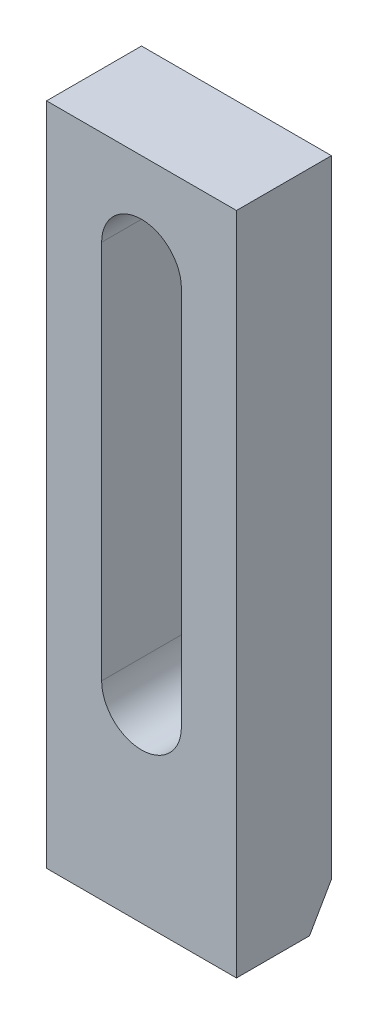
ISO-10303-21;
HEADER;
FILE_DESCRIPTION(('STEP AP214'),'2;1');
FILE_NAME('part.step','',(''),(''),'','','');
FILE_SCHEMA(('AUTOMOTIVE_DESIGN { 1 0 10303 214 1 1 1 1 }'));
ENDSEC;
DATA;
#1=APPLICATION_CONTEXT('core data for automotive mechanical design processes');
#2=APPLICATION_PROTOCOL_DEFINITION('international standard','automotive_design',2000,#1);
#3=PRODUCT_CONTEXT('',#1,'mechanical');
#4=PRODUCT('Part','Part','',(#3));
#5=PRODUCT_RELATED_PRODUCT_CATEGORY('part','',(#4));
#6=PRODUCT_DEFINITION_FORMATION('','',#4);
#7=PRODUCT_DEFINITION_CONTEXT('part definition',#1,'design');
#8=PRODUCT_DEFINITION('design','',#6,#7);
#9=PRODUCT_DEFINITION_SHAPE('','',#8);
#10=(LENGTH_UNIT() NAMED_UNIT(*) SI_UNIT(.MILLI.,.METRE.));
#11=(NAMED_UNIT(*) PLANE_ANGLE_UNIT() SI_UNIT($,.RADIAN.));
#12=(NAMED_UNIT(*) SI_UNIT($,.STERADIAN.) SOLID_ANGLE_UNIT());
#13=UNCERTAINTY_MEASURE_WITH_UNIT(LENGTH_MEASURE(1.E-05),#10,'distance_accuracy_value','');
#14=(GEOMETRIC_REPRESENTATION_CONTEXT(3) GLOBAL_UNCERTAINTY_ASSIGNED_CONTEXT((#13)) GLOBAL_UNIT_ASSIGNED_CONTEXT((#10,
#11,#12)) REPRESENTATION_CONTEXT('',''));
#15=CARTESIAN_POINT('',(0.,0.,0.));
#16=DIRECTION('',(0.,0.,1.));
#17=DIRECTION('',(1.,0.,0.));
#18=AXIS2_PLACEMENT_3D('',#15,#16,#17);
#19=CARTESIAN_POINT('',(0.,0.,25.));
#20=DIRECTION('',(1.,0.,0.));
#21=DIRECTION('',(0.,0.,-1.));
#22=AXIS2_PLACEMENT_3D('',#19,#20,#21);
#23=PLANE('',#22);
#24=DIRECTION('',(0.,-1.,0.));
#25=VECTOR('',#24,1.);
#26=CARTESIAN_POINT('',(0.,0.,0.));
#27=LINE('',#26,#25);
#28=CARTESIAN_POINT('',(0.,175.,0.));
#29=VERTEX_POINT('',#28);
#30=CARTESIAN_POINT('',(0.,10.0000000000001,0.));
#31=VERTEX_POINT('',#30);
#32=EDGE_CURVE('E143',#29,#31,#27,.T.);
#33=ORIENTED_EDGE('',*,*,#32,.T.);
#34=DIRECTION('',(0.,-0.86602540378444,0.499999999999998));
#35=VECTOR('',#34,1.);
#36=CARTESIAN_POINT('',(0.,0.,5.77350269189626));
#37=LINE('',#36,#35);
#38=CARTESIAN_POINT('',(0.,0.,5.77350269189626));
#39=VERTEX_POINT('',#38);
#40=EDGE_CURVE('E11',#31,#39,#37,.T.);
#41=ORIENTED_EDGE('',*,*,#40,.T.);
#42=DIRECTION('',(0.,0.,-1.));
#43=VECTOR('',#42,1.);
#44=CARTESIAN_POINT('',(0.,0.,25.));
#45=LINE('',#44,#43);
#46=CARTESIAN_POINT('',(0.,0.,25.));
#47=VERTEX_POINT('',#46);
#48=EDGE_CURVE('E169',#47,#39,#45,.T.);
#49=ORIENTED_EDGE('',*,*,#48,.F.);
#50=DIRECTION('',(0.,-1.,0.));
#51=VECTOR('',#50,1.);
#52=CARTESIAN_POINT('',(0.,0.,25.));
#53=LINE('',#52,#51);
#54=CARTESIAN_POINT('',(0.,175.,25.));
#55=VERTEX_POINT('',#54);
#56=EDGE_CURVE('E147',#55,#47,#53,.T.);
#57=ORIENTED_EDGE('',*,*,#56,.F.);
#58=DIRECTION('',(0.,0.,-1.));
#59=VECTOR('',#58,1.);
#60=CARTESIAN_POINT('',(0.,175.,25.));
#61=LINE('',#60,#59);
#62=EDGE_CURVE('E157',#55,#29,#61,.T.);
#63=ORIENTED_EDGE('',*,*,#62,.T.);
#64=EDGE_LOOP('',(#33,#41,#49,#57,#63));
#65=FACE_BOUND('',#64,.T.);
#66=ADVANCED_FACE('F34',(#65),#23,.F.);
#67=CARTESIAN_POINT('',(0.,0.,25.));
#68=DIRECTION('',(0.,1.,0.));
#69=DIRECTION('',(0.,0.,1.));
#70=AXIS2_PLACEMENT_3D('',#67,#68,#69);
#71=PLANE('',#70);
#72=ORIENTED_EDGE('',*,*,#48,.T.);
#73=DIRECTION('',(1.,0.,0.));
#74=VECTOR('',#73,1.);
#75=CARTESIAN_POINT('',(50.,0.,5.77350269189626));
#76=LINE('',#75,#74);
#77=CARTESIAN_POINT('',(50.,0.,5.77350269189626));
#78=VERTEX_POINT('',#77);
#79=EDGE_CURVE('E172',#39,#78,#76,.T.);
#80=ORIENTED_EDGE('',*,*,#79,.T.);
#81=DIRECTION('',(0.,0.,-1.));
#82=VECTOR('',#81,1.);
#83=CARTESIAN_POINT('',(50.,0.,25.));
#84=LINE('',#83,#82);
#85=CARTESIAN_POINT('',(50.,0.,25.));
#86=VERTEX_POINT('',#85);
#87=EDGE_CURVE('E167',#86,#78,#84,.T.);
#88=ORIENTED_EDGE('',*,*,#87,.F.);
#89=DIRECTION('',(1.,0.,0.));
#90=VECTOR('',#89,1.);
#91=CARTESIAN_POINT('',(0.,0.,25.));
#92=LINE('',#91,#90);
#93=EDGE_CURVE('E150',#47,#86,#92,.T.);
#94=ORIENTED_EDGE('',*,*,#93,.F.);
#95=EDGE_LOOP('',(#72,#80,#88,#94));
#96=FACE_BOUND('',#95,.T.);
#97=ADVANCED_FACE('F178',(#96),#71,.F.);
#98=CARTESIAN_POINT('',(50.,0.,25.));
#99=DIRECTION('',(-1.,0.,0.));
#100=DIRECTION('',(0.,0.,1.));
#101=AXIS2_PLACEMENT_3D('',#98,#99,#100);
#102=PLANE('',#101);
#103=ORIENTED_EDGE('',*,*,#87,.T.);
#104=DIRECTION('',(0.,0.86602540378444,-0.499999999999998));
#105=VECTOR('',#104,1.);
#106=CARTESIAN_POINT('',(50.,0.,5.77350269189626));
#107=LINE('',#106,#105);
#108=CARTESIAN_POINT('',(50.,10.0000000000001,0.));
#109=VERTEX_POINT('',#108);
#110=EDGE_CURVE('E56',#78,#109,#107,.T.);
#111=ORIENTED_EDGE('',*,*,#110,.T.);
#112=DIRECTION('',(0.,1.,0.));
#113=VECTOR('',#112,1.);
#114=CARTESIAN_POINT('',(50.,0.,0.));
#115=LINE('',#114,#113);
#116=CARTESIAN_POINT('',(50.,175.,0.));
#117=VERTEX_POINT('',#116);
#118=EDGE_CURVE('E159',#109,#117,#115,.T.);
#119=ORIENTED_EDGE('',*,*,#118,.T.);
#120=DIRECTION('',(0.,0.,-1.));
#121=VECTOR('',#120,1.);
#122=CARTESIAN_POINT('',(50.,175.,25.));
#123=LINE('',#122,#121);
#124=CARTESIAN_POINT('',(50.,175.,25.));
#125=VERTEX_POINT('',#124);
#126=EDGE_CURVE('E164',#125,#117,#123,.T.);
#127=ORIENTED_EDGE('',*,*,#126,.F.);
#128=DIRECTION('',(0.,1.,0.));
#129=VECTOR('',#128,1.);
#130=CARTESIAN_POINT('',(50.,0.,25.));
#131=LINE('',#130,#129);
#132=EDGE_CURVE('E153',#86,#125,#131,.T.);
#133=ORIENTED_EDGE('',*,*,#132,.F.);
#134=EDGE_LOOP('',(#103,#111,#119,#127,#133));
#135=FACE_BOUND('',#134,.T.);
#136=ADVANCED_FACE('F183',(#135),#102,.F.);
#137=CARTESIAN_POINT('',(0.,175.,25.));
#138=DIRECTION('',(0.,-1.,0.));
#139=DIRECTION('',(0.,0.,-1.));
#140=AXIS2_PLACEMENT_3D('',#137,#138,#139);
#141=PLANE('',#140);
#142=DIRECTION('',(-1.,0.,0.));
#143=VECTOR('',#142,1.);
#144=CARTESIAN_POINT('',(0.,175.,0.));
#145=LINE('',#144,#143);
#146=EDGE_CURVE('E151',#117,#29,#145,.T.);
#147=ORIENTED_EDGE('',*,*,#146,.T.);
#148=ORIENTED_EDGE('',*,*,#62,.F.);
#149=DIRECTION('',(-1.,0.,0.));
#150=VECTOR('',#149,1.);
#151=CARTESIAN_POINT('',(0.,175.,25.));
#152=LINE('',#151,#150);
#153=EDGE_CURVE('E155',#125,#55,#152,.T.);
#154=ORIENTED_EDGE('',*,*,#153,.F.);
#155=ORIENTED_EDGE('',*,*,#126,.T.);
#156=EDGE_LOOP('',(#147,#148,#154,#155));
#157=FACE_BOUND('',#156,.T.);
#158=ADVANCED_FACE('F205',(#157),#141,.F.);
#159=CARTESIAN_POINT('',(0.,0.,25.));
#160=DIRECTION('',(0.,0.,-1.));
#161=DIRECTION('',(-1.,0.,0.));
#162=AXIS2_PLACEMENT_3D('',#159,#160,#161);
#163=PLANE('',#162);
#164=DIRECTION('',(0.,1.,0.));
#165=VECTOR('',#164,1.);
#166=CARTESIAN_POINT('',(35.5,50.,25.));
#167=LINE('',#166,#165);
#168=CARTESIAN_POINT('',(35.5,50.,25.));
#169=VERTEX_POINT('',#168);
#170=CARTESIAN_POINT('',(35.5,150.,25.));
#171=VERTEX_POINT('',#170);
#172=EDGE_CURVE('E137',#169,#171,#167,.T.);
#173=ORIENTED_EDGE('',*,*,#172,.F.);
#174=CARTESIAN_POINT('',(25.,50.,25.));
#175=DIRECTION('',(0.,0.,1.));
#176=DIRECTION('',(1.,0.,0.));
#177=AXIS2_PLACEMENT_3D('',#174,#175,#176);
#178=CIRCLE('',#177,10.5);
#179=CARTESIAN_POINT('',(14.5,50.,25.));
#180=VERTEX_POINT('',#179);
#181=EDGE_CURVE('E111',#180,#169,#178,.T.);
#182=ORIENTED_EDGE('',*,*,#181,.F.);
#183=DIRECTION('',(0.,-1.,0.));
#184=VECTOR('',#183,1.);
#185=CARTESIAN_POINT('',(14.5,50.,25.));
#186=LINE('',#185,#184);
#187=CARTESIAN_POINT('',(14.5,150.,25.));
#188=VERTEX_POINT('',#187);
#189=EDGE_CURVE('E128',#188,#180,#186,.T.);
#190=ORIENTED_EDGE('',*,*,#189,.F.);
#191=CARTESIAN_POINT('',(25.,150.,25.));
#192=DIRECTION('',(0.,0.,1.));
#193=DIRECTION('',(-1.,0.,0.));
#194=AXIS2_PLACEMENT_3D('',#191,#192,#193);
#195=CIRCLE('',#194,10.5);
#196=EDGE_CURVE('E131',#171,#188,#195,.T.);
#197=ORIENTED_EDGE('',*,*,#196,.F.);
#198=EDGE_LOOP('',(#173,#182,#190,#197));
#199=FACE_BOUND('',#198,.T.);
#200=ORIENTED_EDGE('',*,*,#56,.T.);
#201=ORIENTED_EDGE('',*,*,#93,.T.);
#202=ORIENTED_EDGE('',*,*,#132,.T.);
#203=ORIENTED_EDGE('',*,*,#153,.T.);
#204=EDGE_LOOP('',(#200,#201,#202,#203));
#205=FACE_BOUND('',#204,.T.);
#206=ADVANCED_FACE('F187',(#199,#205),#163,.F.);
#207=CARTESIAN_POINT('',(0.,0.,0.));
#208=DIRECTION('',(0.,0.,-1.));
#209=DIRECTION('',(-1.,0.,0.));
#210=AXIS2_PLACEMENT_3D('',#207,#208,#209);
#211=PLANE('',#210);
#212=CARTESIAN_POINT('',(25.,50.,0.));
#213=DIRECTION('',(0.,0.,1.));
#214=DIRECTION('',(1.,0.,0.));
#215=AXIS2_PLACEMENT_3D('',#212,#213,#214);
#216=CIRCLE('',#215,10.5);
#217=CARTESIAN_POINT('',(14.5,50.,0.));
#218=VERTEX_POINT('',#217);
#219=CARTESIAN_POINT('',(35.5,50.,0.));
#220=VERTEX_POINT('',#219);
#221=EDGE_CURVE('E108',#218,#220,#216,.T.);
#222=ORIENTED_EDGE('',*,*,#221,.T.);
#223=DIRECTION('',(0.,1.,0.));
#224=VECTOR('',#223,1.);
#225=CARTESIAN_POINT('',(35.5,50.,0.));
#226=LINE('',#225,#224);
#227=CARTESIAN_POINT('',(35.5,150.,0.));
#228=VERTEX_POINT('',#227);
#229=EDGE_CURVE('E120',#220,#228,#226,.T.);
#230=ORIENTED_EDGE('',*,*,#229,.T.);
#231=CARTESIAN_POINT('',(25.,150.,0.));
#232=DIRECTION('',(0.,0.,1.));
#233=DIRECTION('',(-1.,0.,0.));
#234=AXIS2_PLACEMENT_3D('',#231,#232,#233);
#235=CIRCLE('',#234,10.5);
#236=CARTESIAN_POINT('',(14.5,150.,0.));
#237=VERTEX_POINT('',#236);
#238=EDGE_CURVE('E124',#228,#237,#235,.T.);
#239=ORIENTED_EDGE('',*,*,#238,.T.);
#240=DIRECTION('',(0.,-1.,0.));
#241=VECTOR('',#240,1.);
#242=CARTESIAN_POINT('',(14.5,50.,0.));
#243=LINE('',#242,#241);
#244=EDGE_CURVE('E116',#237,#218,#243,.T.);
#245=ORIENTED_EDGE('',*,*,#244,.T.);
#246=EDGE_LOOP('',(#222,#230,#239,#245));
#247=FACE_BOUND('',#246,.T.);
#248=ORIENTED_EDGE('',*,*,#118,.F.);
#249=DIRECTION('',(-1.,0.,0.));
#250=VECTOR('',#249,1.);
#251=CARTESIAN_POINT('',(0.,10.0000000000001,0.));
#252=LINE('',#251,#250);
#253=EDGE_CURVE('E42',#109,#31,#252,.T.);
#254=ORIENTED_EDGE('',*,*,#253,.T.);
#255=ORIENTED_EDGE('',*,*,#32,.F.);
#256=ORIENTED_EDGE('',*,*,#146,.F.);
#257=EDGE_LOOP('',(#248,#254,#255,#256));
#258=FACE_BOUND('',#257,.T.);
#259=ADVANCED_FACE('F126',(#247,#258),#211,.T.);
#260=CARTESIAN_POINT('',(25.,50.,0.));
#261=DIRECTION('',(0.,0.,1.));
#262=DIRECTION('',(1.,0.,0.));
#263=AXIS2_PLACEMENT_3D('',#260,#261,#262);
#264=CYLINDRICAL_SURFACE('',#263,10.5);
#265=ORIENTED_EDGE('',*,*,#181,.T.);
#266=DIRECTION('',(0.,0.,1.));
#267=VECTOR('',#266,1.);
#268=CARTESIAN_POINT('',(35.5,50.,0.));
#269=LINE('',#268,#267);
#270=EDGE_CURVE('E104',#220,#169,#269,.T.);
#271=ORIENTED_EDGE('',*,*,#270,.F.);
#272=ORIENTED_EDGE('',*,*,#221,.F.);
#273=DIRECTION('',(0.,0.,1.));
#274=VECTOR('',#273,1.);
#275=CARTESIAN_POINT('',(14.5,50.,0.));
#276=LINE('',#275,#274);
#277=EDGE_CURVE('E141',#218,#180,#276,.T.);
#278=ORIENTED_EDGE('',*,*,#277,.T.);
#279=EDGE_LOOP('',(#265,#271,#272,#278));
#280=FACE_BOUND('',#279,.T.);
#281=ADVANCED_FACE('F106',(#280),#264,.F.);
#282=CARTESIAN_POINT('',(14.5,50.,0.));
#283=DIRECTION('',(-1.,0.,0.));
#284=DIRECTION('',(0.,0.,1.));
#285=AXIS2_PLACEMENT_3D('',#282,#283,#284);
#286=PLANE('',#285);
#287=ORIENTED_EDGE('',*,*,#189,.T.);
#288=ORIENTED_EDGE('',*,*,#277,.F.);
#289=ORIENTED_EDGE('',*,*,#244,.F.);
#290=DIRECTION('',(0.,0.,1.));
#291=VECTOR('',#290,1.);
#292=CARTESIAN_POINT('',(14.5,150.,0.));
#293=LINE('',#292,#291);
#294=EDGE_CURVE('E144',#237,#188,#293,.T.);
#295=ORIENTED_EDGE('',*,*,#294,.T.);
#296=EDGE_LOOP('',(#287,#288,#289,#295));
#297=FACE_BOUND('',#296,.T.);
#298=ADVANCED_FACE('F215',(#297),#286,.F.);
#299=CARTESIAN_POINT('',(25.,150.,0.));
#300=DIRECTION('',(0.,0.,1.));
#301=DIRECTION('',(1.,0.,0.));
#302=AXIS2_PLACEMENT_3D('',#299,#300,#301);
#303=CYLINDRICAL_SURFACE('',#302,10.5);
#304=ORIENTED_EDGE('',*,*,#196,.T.);
#305=ORIENTED_EDGE('',*,*,#294,.F.);
#306=ORIENTED_EDGE('',*,*,#238,.F.);
#307=DIRECTION('',(0.,0.,1.));
#308=VECTOR('',#307,1.);
#309=CARTESIAN_POINT('',(35.5,150.,0.));
#310=LINE('',#309,#308);
#311=EDGE_CURVE('E115',#228,#171,#310,.T.);
#312=ORIENTED_EDGE('',*,*,#311,.T.);
#313=EDGE_LOOP('',(#304,#305,#306,#312));
#314=FACE_BOUND('',#313,.T.);
#315=ADVANCED_FACE('F195',(#314),#303,.F.);
#316=CARTESIAN_POINT('',(35.5,50.,0.));
#317=DIRECTION('',(1.,0.,0.));
#318=DIRECTION('',(0.,0.,-1.));
#319=AXIS2_PLACEMENT_3D('',#316,#317,#318);
#320=PLANE('',#319);
#321=ORIENTED_EDGE('',*,*,#172,.T.);
#322=ORIENTED_EDGE('',*,*,#311,.F.);
#323=ORIENTED_EDGE('',*,*,#229,.F.);
#324=ORIENTED_EDGE('',*,*,#270,.T.);
#325=EDGE_LOOP('',(#321,#322,#323,#324));
#326=FACE_BOUND('',#325,.T.);
#327=ADVANCED_FACE('F121',(#326),#320,.F.);
#328=CARTESIAN_POINT('',(0.,0.,5.77350269189626));
#329=DIRECTION('',(0.,-0.499999999999998,-0.86602540378444));
#330=DIRECTION('',(-1.,0.,0.));
#331=AXIS2_PLACEMENT_3D('',#328,#329,#330);
#332=PLANE('',#331);
#333=ORIENTED_EDGE('',*,*,#40,.F.);
#334=ORIENTED_EDGE('',*,*,#253,.F.);
#335=ORIENTED_EDGE('',*,*,#110,.F.);
#336=ORIENTED_EDGE('',*,*,#79,.F.);
#337=EDGE_LOOP('',(#333,#334,#335,#336));
#338=FACE_BOUND('',#337,.T.);
#339=ADVANCED_FACE('F36',(#338),#332,.T.);
#340=CLOSED_SHELL('',(#66,#97,#136,#158,#206,#259,#281,#298,#315,#327,#339));
#341=MANIFOLD_SOLID_BREP('B2',#340);
#342=ADVANCED_BREP_SHAPE_REPRESENTATION('',(#18,#341),#14);
#343=SHAPE_DEFINITION_REPRESENTATION(#9,#342);
ENDSEC;
END-ISO-10303-21;
